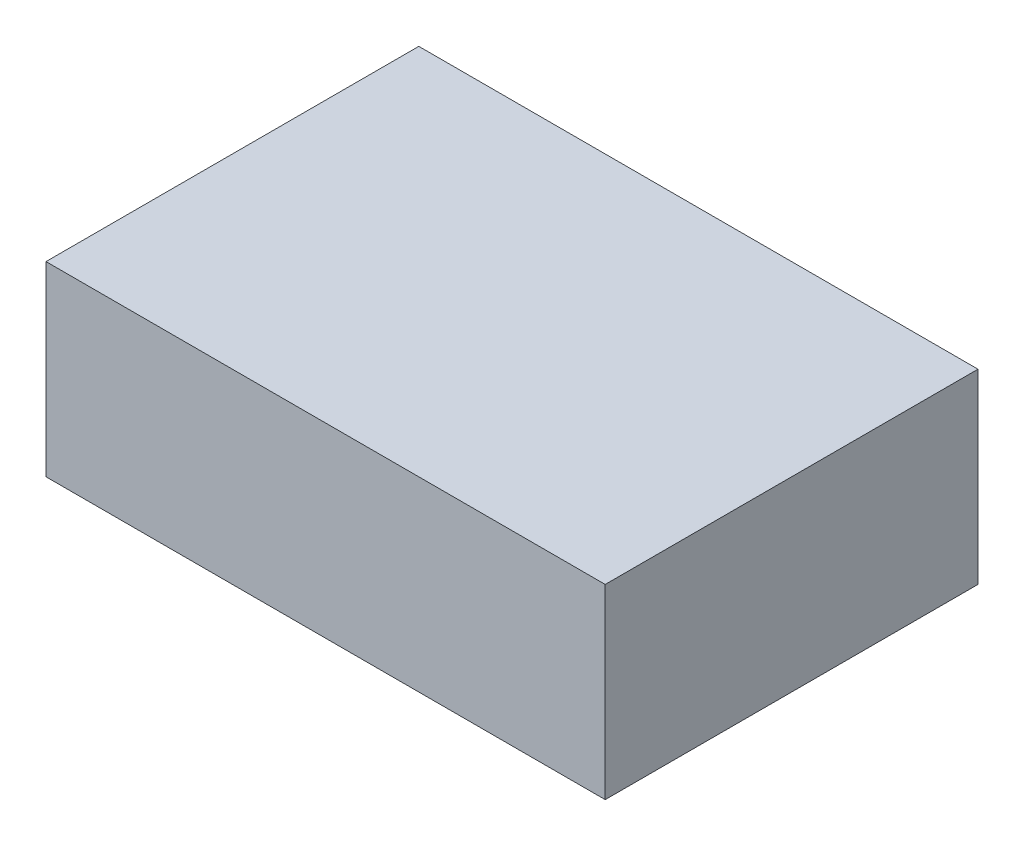
ISO-10303-21;
HEADER;
FILE_DESCRIPTION(('STEP AP214'),'2;1');
FILE_NAME('part.step','',(''),(''),'','','');
FILE_SCHEMA(('AUTOMOTIVE_DESIGN { 1 0 10303 214 1 1 1 1 }'));
ENDSEC;
DATA;
#1=APPLICATION_CONTEXT('core data for automotive mechanical design processes');
#2=APPLICATION_PROTOCOL_DEFINITION('international standard','automotive_design',2000,#1);
#3=PRODUCT_CONTEXT('',#1,'mechanical');
#4=PRODUCT('Part','Part','',(#3));
#5=PRODUCT_RELATED_PRODUCT_CATEGORY('part','',(#4));
#6=PRODUCT_DEFINITION_FORMATION('','',#4);
#7=PRODUCT_DEFINITION_CONTEXT('part definition',#1,'design');
#8=PRODUCT_DEFINITION('design','',#6,#7);
#9=PRODUCT_DEFINITION_SHAPE('','',#8);
#10=(LENGTH_UNIT() NAMED_UNIT(*) SI_UNIT(.MILLI.,.METRE.));
#11=(NAMED_UNIT(*) PLANE_ANGLE_UNIT() SI_UNIT($,.RADIAN.));
#12=(NAMED_UNIT(*) SI_UNIT($,.STERADIAN.) SOLID_ANGLE_UNIT());
#13=UNCERTAINTY_MEASURE_WITH_UNIT(LENGTH_MEASURE(1.E-05),#10,'distance_accuracy_value','');
#14=(GEOMETRIC_REPRESENTATION_CONTEXT(3) GLOBAL_UNCERTAINTY_ASSIGNED_CONTEXT((#13)) GLOBAL_UNIT_ASSIGNED_CONTEXT((#10,
#11,#12)) REPRESENTATION_CONTEXT('',''));
#15=CARTESIAN_POINT('',(0.,0.,0.));
#16=DIRECTION('',(0.,0.,1.));
#17=DIRECTION('',(1.,0.,0.));
#18=AXIS2_PLACEMENT_3D('',#15,#16,#17);
#19=CARTESIAN_POINT('',(0.6,0.4,-0.4));
#20=DIRECTION('',(-1.,0.,0.));
#21=DIRECTION('',(0.,0.,1.));
#22=AXIS2_PLACEMENT_3D('',#19,#20,#21);
#23=PLANE('',#22);
#24=DIRECTION('',(0.,0.,-1.));
#25=VECTOR('',#24,1.);
#26=CARTESIAN_POINT('',(0.6,0.,-0.4));
#27=LINE('',#26,#25);
#28=CARTESIAN_POINT('',(0.6,0.,0.4));
#29=VERTEX_POINT('',#28);
#30=CARTESIAN_POINT('',(0.6,0.,-0.4));
#31=VERTEX_POINT('',#30);
#32=EDGE_CURVE('E97',#29,#31,#27,.T.);
#33=ORIENTED_EDGE('',*,*,#32,.T.);
#34=DIRECTION('',(0.,-1.,0.));
#35=VECTOR('',#34,1.);
#36=CARTESIAN_POINT('',(0.6,0.4,-0.4));
#37=LINE('',#36,#35);
#38=CARTESIAN_POINT('',(0.6,0.4,-0.4));
#39=VERTEX_POINT('',#38);
#40=EDGE_CURVE('E11',#39,#31,#37,.T.);
#41=ORIENTED_EDGE('',*,*,#40,.F.);
#42=DIRECTION('',(0.,0.,-1.));
#43=VECTOR('',#42,1.);
#44=CARTESIAN_POINT('',(0.6,0.4,-0.4));
#45=LINE('',#44,#43);
#46=CARTESIAN_POINT('',(0.6,0.4,0.4));
#47=VERTEX_POINT('',#46);
#48=EDGE_CURVE('E85',#47,#39,#45,.T.);
#49=ORIENTED_EDGE('',*,*,#48,.F.);
#50=DIRECTION('',(0.,-1.,0.));
#51=VECTOR('',#50,1.);
#52=CARTESIAN_POINT('',(0.6,0.4,0.4));
#53=LINE('',#52,#51);
#54=EDGE_CURVE('E93',#47,#29,#53,.T.);
#55=ORIENTED_EDGE('',*,*,#54,.T.);
#56=EDGE_LOOP('',(#33,#41,#49,#55));
#57=FACE_BOUND('',#56,.T.);
#58=ADVANCED_FACE('F34',(#57),#23,.F.);
#59=CARTESIAN_POINT('',(-0.6,0.4,-0.4));
#60=DIRECTION('',(0.,0.,1.));
#61=DIRECTION('',(1.,0.,0.));
#62=AXIS2_PLACEMENT_3D('',#59,#60,#61);
#63=PLANE('',#62);
#64=DIRECTION('',(-1.,0.,0.));
#65=VECTOR('',#64,1.);
#66=CARTESIAN_POINT('',(-0.6,0.,-0.4));
#67=LINE('',#66,#65);
#68=CARTESIAN_POINT('',(-0.6,0.,-0.4));
#69=VERTEX_POINT('',#68);
#70=EDGE_CURVE('E89',#31,#69,#67,.T.);
#71=ORIENTED_EDGE('',*,*,#70,.T.);
#72=DIRECTION('',(0.,-1.,0.));
#73=VECTOR('',#72,1.);
#74=CARTESIAN_POINT('',(-0.6,0.4,-0.4));
#75=LINE('',#74,#73);
#76=CARTESIAN_POINT('',(-0.6,0.4,-0.4));
#77=VERTEX_POINT('',#76);
#78=EDGE_CURVE('E42',#77,#69,#75,.T.);
#79=ORIENTED_EDGE('',*,*,#78,.F.);
#80=DIRECTION('',(-1.,0.,0.));
#81=VECTOR('',#80,1.);
#82=CARTESIAN_POINT('',(-0.6,0.4,-0.4));
#83=LINE('',#82,#81);
#84=EDGE_CURVE('E80',#39,#77,#83,.T.);
#85=ORIENTED_EDGE('',*,*,#84,.F.);
#86=ORIENTED_EDGE('',*,*,#40,.T.);
#87=EDGE_LOOP('',(#71,#79,#85,#86));
#88=FACE_BOUND('',#87,.T.);
#89=ADVANCED_FACE('F88',(#88),#63,.F.);
#90=CARTESIAN_POINT('',(-0.6,0.4,-0.4));
#91=DIRECTION('',(1.,0.,0.));
#92=DIRECTION('',(0.,0.,-1.));
#93=AXIS2_PLACEMENT_3D('',#90,#91,#92);
#94=PLANE('',#93);
#95=DIRECTION('',(0.,0.,1.));
#96=VECTOR('',#95,1.);
#97=CARTESIAN_POINT('',(-0.6,0.,-0.4));
#98=LINE('',#97,#96);
#99=CARTESIAN_POINT('',(-0.6,0.,0.4));
#100=VERTEX_POINT('',#99);
#101=EDGE_CURVE('E67',#69,#100,#98,.T.);
#102=ORIENTED_EDGE('',*,*,#101,.T.);
#103=DIRECTION('',(0.,-1.,0.));
#104=VECTOR('',#103,1.);
#105=CARTESIAN_POINT('',(-0.6,0.4,0.4));
#106=LINE('',#105,#104);
#107=CARTESIAN_POINT('',(-0.6,0.4,0.4));
#108=VERTEX_POINT('',#107);
#109=EDGE_CURVE('E90',#108,#100,#106,.T.);
#110=ORIENTED_EDGE('',*,*,#109,.F.);
#111=DIRECTION('',(0.,0.,1.));
#112=VECTOR('',#111,1.);
#113=CARTESIAN_POINT('',(-0.6,0.4,-0.4));
#114=LINE('',#113,#112);
#115=EDGE_CURVE('E83',#77,#108,#114,.T.);
#116=ORIENTED_EDGE('',*,*,#115,.F.);
#117=ORIENTED_EDGE('',*,*,#78,.T.);
#118=EDGE_LOOP('',(#102,#110,#116,#117));
#119=FACE_BOUND('',#118,.T.);
#120=ADVANCED_FACE('F91',(#119),#94,.F.);
#121=CARTESIAN_POINT('',(-0.6,0.4,0.4));
#122=DIRECTION('',(0.,0.,-1.));
#123=DIRECTION('',(-1.,0.,0.));
#124=AXIS2_PLACEMENT_3D('',#121,#122,#123);
#125=PLANE('',#124);
#126=DIRECTION('',(1.,0.,0.));
#127=VECTOR('',#126,1.);
#128=CARTESIAN_POINT('',(-0.6,0.,0.4));
#129=LINE('',#128,#127);
#130=EDGE_CURVE('E73',#100,#29,#129,.T.);
#131=ORIENTED_EDGE('',*,*,#130,.T.);
#132=ORIENTED_EDGE('',*,*,#54,.F.);
#133=DIRECTION('',(1.,0.,0.));
#134=VECTOR('',#133,1.);
#135=CARTESIAN_POINT('',(-0.6,0.4,0.4));
#136=LINE('',#135,#134);
#137=EDGE_CURVE('E50',#108,#47,#136,.T.);
#138=ORIENTED_EDGE('',*,*,#137,.F.);
#139=ORIENTED_EDGE('',*,*,#109,.T.);
#140=EDGE_LOOP('',(#131,#132,#138,#139));
#141=FACE_BOUND('',#140,.T.);
#142=ADVANCED_FACE('F104',(#141),#125,.F.);
#143=CARTESIAN_POINT('',(0.,0.4,0.));
#144=DIRECTION('',(0.,1.,0.));
#145=DIRECTION('',(0.,0.,1.));
#146=AXIS2_PLACEMENT_3D('',#143,#144,#145);
#147=PLANE('',#146);
#148=ORIENTED_EDGE('',*,*,#48,.T.);
#149=ORIENTED_EDGE('',*,*,#84,.T.);
#150=ORIENTED_EDGE('',*,*,#115,.T.);
#151=ORIENTED_EDGE('',*,*,#137,.T.);
#152=EDGE_LOOP('',(#148,#149,#150,#151));
#153=FACE_BOUND('',#152,.T.);
#154=ADVANCED_FACE('F81',(#153),#147,.T.);
#155=CARTESIAN_POINT('',(0.,0.,0.));
#156=DIRECTION('',(0.,1.,0.));
#157=DIRECTION('',(0.,0.,1.));
#158=AXIS2_PLACEMENT_3D('',#155,#156,#157);
#159=PLANE('',#158);
#160=ORIENTED_EDGE('',*,*,#32,.F.);
#161=ORIENTED_EDGE('',*,*,#130,.F.);
#162=ORIENTED_EDGE('',*,*,#101,.F.);
#163=ORIENTED_EDGE('',*,*,#70,.F.);
#164=EDGE_LOOP('',(#160,#161,#162,#163));
#165=FACE_BOUND('',#164,.T.);
#166=ADVANCED_FACE('F107',(#165),#159,.F.);
#167=CLOSED_SHELL('',(#58,#89,#120,#142,#154,#166));
#168=MANIFOLD_SOLID_BREP('B2',#167);
#169=ADVANCED_BREP_SHAPE_REPRESENTATION('',(#18,#168),#14);
#170=SHAPE_DEFINITION_REPRESENTATION(#9,#169);
ENDSEC;
END-ISO-10303-21;
